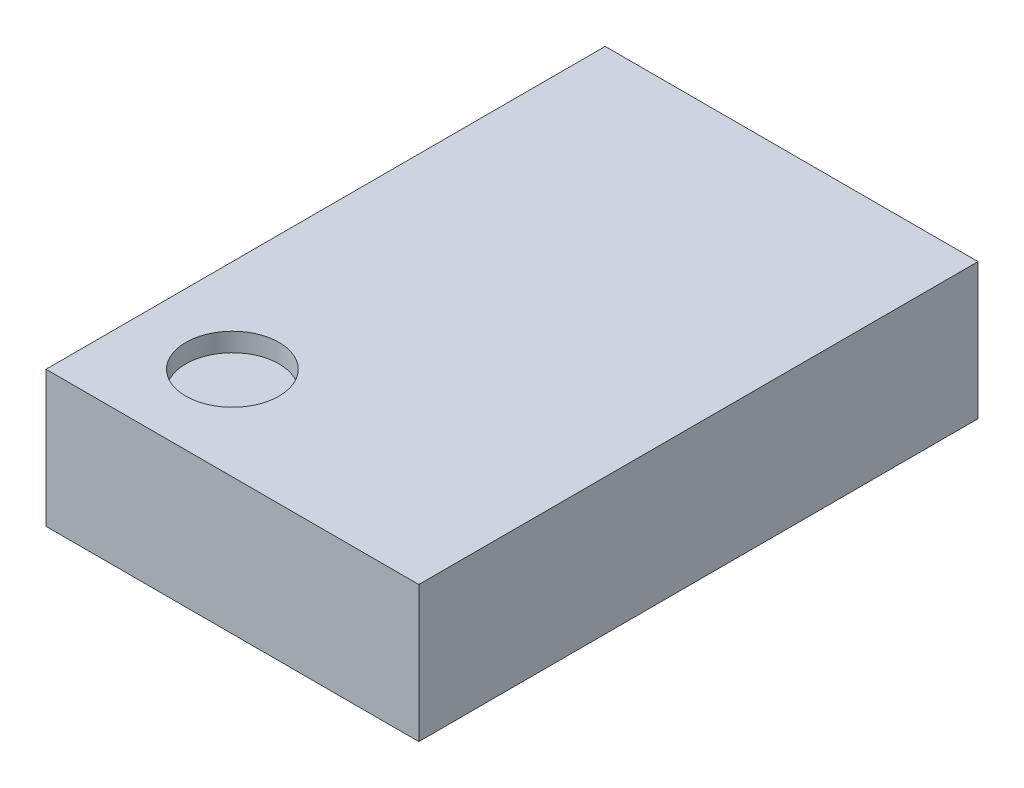
ISO-10303-21;
HEADER;
FILE_DESCRIPTION(('STEP AP214'),'2;1');
FILE_NAME('part.step','',(''),(''),'','','');
FILE_SCHEMA(('AUTOMOTIVE_DESIGN { 1 0 10303 214 1 1 1 1 }'));
ENDSEC;
DATA;
#1=APPLICATION_CONTEXT('core data for automotive mechanical design processes');
#2=APPLICATION_PROTOCOL_DEFINITION('international standard','automotive_design',2000,#1);
#3=PRODUCT_CONTEXT('',#1,'mechanical');
#4=PRODUCT('Part','Part','',(#3));
#5=PRODUCT_RELATED_PRODUCT_CATEGORY('part','',(#4));
#6=PRODUCT_DEFINITION_FORMATION('','',#4);
#7=PRODUCT_DEFINITION_CONTEXT('part definition',#1,'design');
#8=PRODUCT_DEFINITION('design','',#6,#7);
#9=PRODUCT_DEFINITION_SHAPE('','',#8);
#10=(LENGTH_UNIT() NAMED_UNIT(*) SI_UNIT(.MILLI.,.METRE.));
#11=(NAMED_UNIT(*) PLANE_ANGLE_UNIT() SI_UNIT($,.RADIAN.));
#12=(NAMED_UNIT(*) SI_UNIT($,.STERADIAN.) SOLID_ANGLE_UNIT());
#13=UNCERTAINTY_MEASURE_WITH_UNIT(LENGTH_MEASURE(1.E-05),#10,'distance_accuracy_value','');
#14=(GEOMETRIC_REPRESENTATION_CONTEXT(3) GLOBAL_UNCERTAINTY_ASSIGNED_CONTEXT((#13)) GLOBAL_UNIT_ASSIGNED_CONTEXT((#10,
#11,#12)) REPRESENTATION_CONTEXT('',''));
#15=CARTESIAN_POINT('',(0.,0.,0.));
#16=DIRECTION('',(0.,0.,1.));
#17=DIRECTION('',(1.,0.,0.));
#18=AXIS2_PLACEMENT_3D('',#15,#16,#17);
#19=CARTESIAN_POINT('',(1.,0.73,-1.5));
#20=DIRECTION('',(-1.,0.,0.));
#21=DIRECTION('',(0.,0.,1.));
#22=AXIS2_PLACEMENT_3D('',#19,#20,#21);
#23=PLANE('',#22);
#24=DIRECTION('',(0.,0.,-1.));
#25=VECTOR('',#24,1.);
#26=CARTESIAN_POINT('',(1.,0.,-1.5));
#27=LINE('',#26,#25);
#28=CARTESIAN_POINT('',(1.,0.,1.5));
#29=VERTEX_POINT('',#28);
#30=CARTESIAN_POINT('',(1.,0.,-1.5));
#31=VERTEX_POINT('',#30);
#32=EDGE_CURVE('E109',#29,#31,#27,.T.);
#33=ORIENTED_EDGE('',*,*,#32,.T.);
#34=DIRECTION('',(0.,-1.,0.));
#35=VECTOR('',#34,1.);
#36=CARTESIAN_POINT('',(1.,0.73,-1.5));
#37=LINE('',#36,#35);
#38=CARTESIAN_POINT('',(1.,0.73,-1.5));
#39=VERTEX_POINT('',#38);
#40=EDGE_CURVE('E11',#39,#31,#37,.T.);
#41=ORIENTED_EDGE('',*,*,#40,.F.);
#42=DIRECTION('',(0.,0.,-1.));
#43=VECTOR('',#42,1.);
#44=CARTESIAN_POINT('',(1.,0.73,-1.5));
#45=LINE('',#44,#43);
#46=CARTESIAN_POINT('',(1.,0.73,1.5));
#47=VERTEX_POINT('',#46);
#48=EDGE_CURVE('E93',#47,#39,#45,.T.);
#49=ORIENTED_EDGE('',*,*,#48,.F.);
#50=DIRECTION('',(0.,-1.,0.));
#51=VECTOR('',#50,1.);
#52=CARTESIAN_POINT('',(1.,0.73,1.5));
#53=LINE('',#52,#51);
#54=EDGE_CURVE('E105',#47,#29,#53,.T.);
#55=ORIENTED_EDGE('',*,*,#54,.T.);
#56=EDGE_LOOP('',(#33,#41,#49,#55));
#57=FACE_BOUND('',#56,.T.);
#58=ADVANCED_FACE('F41',(#57),#23,.F.);
#59=CARTESIAN_POINT('',(-1.,0.73,-1.5));
#60=DIRECTION('',(0.,0.,1.));
#61=DIRECTION('',(1.,0.,0.));
#62=AXIS2_PLACEMENT_3D('',#59,#60,#61);
#63=PLANE('',#62);
#64=DIRECTION('',(-1.,0.,0.));
#65=VECTOR('',#64,1.);
#66=CARTESIAN_POINT('',(-1.,0.,-1.5));
#67=LINE('',#66,#65);
#68=CARTESIAN_POINT('',(-1.,0.,-1.5));
#69=VERTEX_POINT('',#68);
#70=EDGE_CURVE('E98',#31,#69,#67,.T.);
#71=ORIENTED_EDGE('',*,*,#70,.T.);
#72=DIRECTION('',(0.,-1.,0.));
#73=VECTOR('',#72,1.);
#74=CARTESIAN_POINT('',(-1.,0.73,-1.5));
#75=LINE('',#74,#73);
#76=CARTESIAN_POINT('',(-1.,0.73,-1.5));
#77=VERTEX_POINT('',#76);
#78=EDGE_CURVE('E50',#77,#69,#75,.T.);
#79=ORIENTED_EDGE('',*,*,#78,.F.);
#80=DIRECTION('',(-1.,0.,0.));
#81=VECTOR('',#80,1.);
#82=CARTESIAN_POINT('',(-1.,0.73,-1.5));
#83=LINE('',#82,#81);
#84=EDGE_CURVE('E88',#39,#77,#83,.T.);
#85=ORIENTED_EDGE('',*,*,#84,.F.);
#86=ORIENTED_EDGE('',*,*,#40,.T.);
#87=EDGE_LOOP('',(#71,#79,#85,#86));
#88=FACE_BOUND('',#87,.T.);
#89=ADVANCED_FACE('F97',(#88),#63,.F.);
#90=CARTESIAN_POINT('',(-1.,0.73,-1.5));
#91=DIRECTION('',(1.,0.,0.));
#92=DIRECTION('',(0.,0.,-1.));
#93=AXIS2_PLACEMENT_3D('',#90,#91,#92);
#94=PLANE('',#93);
#95=DIRECTION('',(0.,0.,1.));
#96=VECTOR('',#95,1.);
#97=CARTESIAN_POINT('',(-1.,0.,-1.5));
#98=LINE('',#97,#96);
#99=CARTESIAN_POINT('',(-1.,0.,1.5));
#100=VERTEX_POINT('',#99);
#101=EDGE_CURVE('E75',#69,#100,#98,.T.);
#102=ORIENTED_EDGE('',*,*,#101,.T.);
#103=DIRECTION('',(0.,-1.,0.));
#104=VECTOR('',#103,1.);
#105=CARTESIAN_POINT('',(-1.,0.73,1.5));
#106=LINE('',#105,#104);
#107=CARTESIAN_POINT('',(-1.,0.73,1.5));
#108=VERTEX_POINT('',#107);
#109=EDGE_CURVE('E100',#108,#100,#106,.T.);
#110=ORIENTED_EDGE('',*,*,#109,.F.);
#111=DIRECTION('',(0.,0.,1.));
#112=VECTOR('',#111,1.);
#113=CARTESIAN_POINT('',(-1.,0.73,-1.5));
#114=LINE('',#113,#112);
#115=EDGE_CURVE('E91',#77,#108,#114,.T.);
#116=ORIENTED_EDGE('',*,*,#115,.F.);
#117=ORIENTED_EDGE('',*,*,#78,.T.);
#118=EDGE_LOOP('',(#102,#110,#116,#117));
#119=FACE_BOUND('',#118,.T.);
#120=ADVANCED_FACE('F101',(#119),#94,.F.);
#121=CARTESIAN_POINT('',(-1.,0.73,1.5));
#122=DIRECTION('',(0.,0.,-1.));
#123=DIRECTION('',(-1.,0.,0.));
#124=AXIS2_PLACEMENT_3D('',#121,#122,#123);
#125=PLANE('',#124);
#126=DIRECTION('',(1.,0.,0.));
#127=VECTOR('',#126,1.);
#128=CARTESIAN_POINT('',(-1.,0.,1.5));
#129=LINE('',#128,#127);
#130=EDGE_CURVE('E81',#100,#29,#129,.T.);
#131=ORIENTED_EDGE('',*,*,#130,.T.);
#132=ORIENTED_EDGE('',*,*,#54,.F.);
#133=DIRECTION('',(1.,0.,0.));
#134=VECTOR('',#133,1.);
#135=CARTESIAN_POINT('',(-1.,0.73,1.5));
#136=LINE('',#135,#134);
#137=EDGE_CURVE('E58',#108,#47,#136,.T.);
#138=ORIENTED_EDGE('',*,*,#137,.F.);
#139=ORIENTED_EDGE('',*,*,#109,.T.);
#140=EDGE_LOOP('',(#131,#132,#138,#139));
#141=FACE_BOUND('',#140,.T.);
#142=ADVANCED_FACE('F123',(#141),#125,.F.);
#143=CARTESIAN_POINT('',(0.,0.73,0.));
#144=DIRECTION('',(0.,1.,0.));
#145=DIRECTION('',(0.,0.,1.));
#146=AXIS2_PLACEMENT_3D('',#143,#144,#145);
#147=PLANE('',#146);
#148=CARTESIAN_POINT('',(-0.5,0.73,1.));
#149=DIRECTION('',(0.,1.,0.));
#150=DIRECTION('',(0.,0.,1.));
#151=AXIS2_PLACEMENT_3D('',#148,#149,#150);
#152=CIRCLE('',#151,0.25);
#153=CARTESIAN_POINT('',(-0.5,0.73,1.25));
#154=VERTEX_POINT('',#153);
#155=EDGE_CURVE('E130',#154,#154,#152,.T.);
#156=ORIENTED_EDGE('',*,*,#155,.F.);
#157=EDGE_LOOP('',(#156));
#158=FACE_BOUND('',#157,.T.);
#159=ORIENTED_EDGE('',*,*,#48,.T.);
#160=ORIENTED_EDGE('',*,*,#84,.T.);
#161=ORIENTED_EDGE('',*,*,#115,.T.);
#162=ORIENTED_EDGE('',*,*,#137,.T.);
#163=EDGE_LOOP('',(#159,#160,#161,#162));
#164=FACE_BOUND('',#163,.T.);
#165=ADVANCED_FACE('F89',(#158,#164),#147,.T.);
#166=CARTESIAN_POINT('',(0.,0.,0.));
#167=DIRECTION('',(0.,1.,0.));
#168=DIRECTION('',(0.,0.,1.));
#169=AXIS2_PLACEMENT_3D('',#166,#167,#168);
#170=PLANE('',#169);
#171=ORIENTED_EDGE('',*,*,#32,.F.);
#172=ORIENTED_EDGE('',*,*,#130,.F.);
#173=ORIENTED_EDGE('',*,*,#101,.F.);
#174=ORIENTED_EDGE('',*,*,#70,.F.);
#175=EDGE_LOOP('',(#171,#172,#173,#174));
#176=FACE_BOUND('',#175,.T.);
#177=ADVANCED_FACE('F126',(#176),#170,.F.);
#178=CARTESIAN_POINT('',(-0.5,0.63,1.));
#179=DIRECTION('',(0.,1.,0.));
#180=DIRECTION('',(0.,0.,1.));
#181=AXIS2_PLACEMENT_3D('',#178,#179,#180);
#182=CYLINDRICAL_SURFACE('',#181,0.25);
#183=CARTESIAN_POINT('',(-0.5,0.63,1.));
#184=DIRECTION('',(0.,1.,0.));
#185=DIRECTION('',(0.,0.,1.));
#186=AXIS2_PLACEMENT_3D('',#183,#184,#185);
#187=CIRCLE('',#186,0.25);
#188=CARTESIAN_POINT('',(-0.5,0.63,1.25));
#189=VERTEX_POINT('',#188);
#190=EDGE_CURVE('E113',#189,#189,#187,.T.);
#191=ORIENTED_EDGE('',*,*,#190,.F.);
#192=EDGE_LOOP('',(#191));
#193=FACE_BOUND('',#192,.T.);
#194=ORIENTED_EDGE('',*,*,#155,.T.);
#195=EDGE_LOOP('',(#194));
#196=FACE_BOUND('',#195,.T.);
#197=ADVANCED_FACE('F140',(#193,#196),#182,.F.);
#198=CARTESIAN_POINT('',(-0.5,0.63,1.));
#199=DIRECTION('',(0.,1.,0.));
#200=DIRECTION('',(0.,0.,1.));
#201=AXIS2_PLACEMENT_3D('',#198,#199,#200);
#202=PLANE('',#201);
#203=ORIENTED_EDGE('',*,*,#190,.T.);
#204=EDGE_LOOP('',(#203));
#205=FACE_BOUND('',#204,.T.);
#206=ADVANCED_FACE('F138',(#205),#202,.T.);
#207=CLOSED_SHELL('',(#58,#89,#120,#142,#165,#177,#197,#206));
#208=MANIFOLD_SOLID_BREP('B2',#207);
#209=ADVANCED_BREP_SHAPE_REPRESENTATION('',(#18,#208),#14);
#210=SHAPE_DEFINITION_REPRESENTATION(#9,#209);
ENDSEC;
END-ISO-10303-21;
